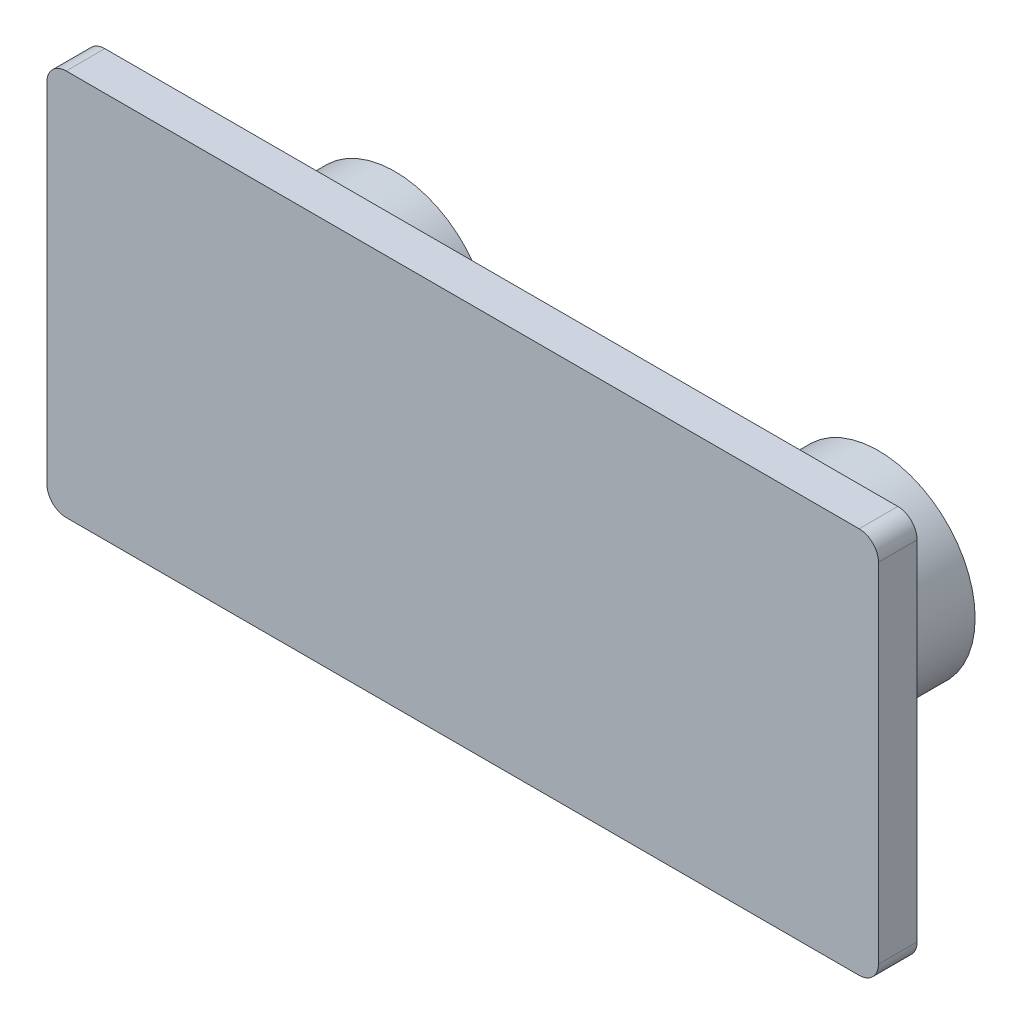
ISO-10303-21;
HEADER;
FILE_DESCRIPTION(('STEP AP214'),'2;1');
FILE_NAME('part.step','',(''),(''),'','','');
FILE_SCHEMA(('AUTOMOTIVE_DESIGN { 1 0 10303 214 1 1 1 1 }'));
ENDSEC;
DATA;
#1=APPLICATION_CONTEXT('core data for automotive mechanical design processes');
#2=APPLICATION_PROTOCOL_DEFINITION('international standard','automotive_design',2000,#1);
#3=PRODUCT_CONTEXT('',#1,'mechanical');
#4=PRODUCT('Part','Part','',(#3));
#5=PRODUCT_RELATED_PRODUCT_CATEGORY('part','',(#4));
#6=PRODUCT_DEFINITION_FORMATION('','',#4);
#7=PRODUCT_DEFINITION_CONTEXT('part definition',#1,'design');
#8=PRODUCT_DEFINITION('design','',#6,#7);
#9=PRODUCT_DEFINITION_SHAPE('','',#8);
#10=(LENGTH_UNIT() NAMED_UNIT(*) SI_UNIT(.MILLI.,.METRE.));
#11=(NAMED_UNIT(*) PLANE_ANGLE_UNIT() SI_UNIT($,.RADIAN.));
#12=(NAMED_UNIT(*) SI_UNIT($,.STERADIAN.) SOLID_ANGLE_UNIT());
#13=UNCERTAINTY_MEASURE_WITH_UNIT(LENGTH_MEASURE(1.E-05),#10,'distance_accuracy_value','');
#14=(GEOMETRIC_REPRESENTATION_CONTEXT(3) GLOBAL_UNCERTAINTY_ASSIGNED_CONTEXT((#13)) GLOBAL_UNIT_ASSIGNED_CONTEXT((#10,
#11,#12)) REPRESENTATION_CONTEXT('',''));
#15=CARTESIAN_POINT('',(0.,0.,0.));
#16=DIRECTION('',(0.,0.,1.));
#17=DIRECTION('',(1.,0.,0.));
#18=AXIS2_PLACEMENT_3D('',#15,#16,#17);
#19=CARTESIAN_POINT('',(21.5,-10.,1.));
#20=DIRECTION('',(-1.,0.,0.));
#21=DIRECTION('',(0.,0.,1.));
#22=AXIS2_PLACEMENT_3D('',#19,#20,#21);
#23=PLANE('',#22);
#24=DIRECTION('',(0.,1.,0.));
#25=VECTOR('',#24,1.);
#26=CARTESIAN_POINT('',(21.5,-10.,-1.));
#27=LINE('',#26,#25);
#28=CARTESIAN_POINT('',(21.5,-9.,-1.));
#29=VERTEX_POINT('',#28);
#30=CARTESIAN_POINT('',(21.5,9.,-1.));
#31=VERTEX_POINT('',#30);
#32=EDGE_CURVE('E126',#29,#31,#27,.T.);
#33=ORIENTED_EDGE('',*,*,#32,.T.);
#34=DIRECTION('',(0.,0.,-1.));
#35=VECTOR('',#34,1.);
#36=CARTESIAN_POINT('',(21.5,9.,1.));
#37=LINE('',#36,#35);
#38=CARTESIAN_POINT('',(21.5,9.,1.));
#39=VERTEX_POINT('',#38);
#40=EDGE_CURVE('E104',#31,#39,#37,.F.);
#41=ORIENTED_EDGE('',*,*,#40,.T.);
#42=DIRECTION('',(0.,1.,0.));
#43=VECTOR('',#42,1.);
#44=CARTESIAN_POINT('',(21.5,-10.,1.));
#45=LINE('',#44,#43);
#46=CARTESIAN_POINT('',(21.5,-9.,1.));
#47=VERTEX_POINT('',#46);
#48=EDGE_CURVE('E136',#47,#39,#45,.T.);
#49=ORIENTED_EDGE('',*,*,#48,.F.);
#50=DIRECTION('',(0.,0.,-1.));
#51=VECTOR('',#50,1.);
#52=CARTESIAN_POINT('',(21.5,-9.,1.));
#53=LINE('',#52,#51);
#54=EDGE_CURVE('E109',#47,#29,#53,.T.);
#55=ORIENTED_EDGE('',*,*,#54,.T.);
#56=EDGE_LOOP('',(#33,#41,#49,#55));
#57=FACE_BOUND('',#56,.T.);
#58=ADVANCED_FACE('F33',(#57),#23,.F.);
#59=CARTESIAN_POINT('',(-21.5,10.,1.));
#60=DIRECTION('',(0.,-1.,0.));
#61=DIRECTION('',(0.,0.,-1.));
#62=AXIS2_PLACEMENT_3D('',#59,#60,#61);
#63=PLANE('',#62);
#64=DIRECTION('',(-1.,0.,0.));
#65=VECTOR('',#64,1.);
#66=CARTESIAN_POINT('',(-21.5,10.,1.));
#67=LINE('',#66,#65);
#68=CARTESIAN_POINT('',(20.5,10.,1.));
#69=VERTEX_POINT('',#68);
#70=CARTESIAN_POINT('',(-20.5,10.,1.));
#71=VERTEX_POINT('',#70);
#72=EDGE_CURVE('E119',#69,#71,#67,.T.);
#73=ORIENTED_EDGE('',*,*,#72,.F.);
#74=DIRECTION('',(0.,0.,-1.));
#75=VECTOR('',#74,1.);
#76=CARTESIAN_POINT('',(20.5,10.,1.));
#77=LINE('',#76,#75);
#78=CARTESIAN_POINT('',(20.5,10.,-1.));
#79=VERTEX_POINT('',#78);
#80=EDGE_CURVE('E103',#69,#79,#77,.T.);
#81=ORIENTED_EDGE('',*,*,#80,.T.);
#82=DIRECTION('',(-1.,0.,0.));
#83=VECTOR('',#82,1.);
#84=CARTESIAN_POINT('',(-21.5,10.,-1.));
#85=LINE('',#84,#83);
#86=CARTESIAN_POINT('',(-20.5,10.,-1.));
#87=VERTEX_POINT('',#86);
#88=EDGE_CURVE('E116',#79,#87,#85,.T.);
#89=ORIENTED_EDGE('',*,*,#88,.T.);
#90=DIRECTION('',(0.,0.,-1.));
#91=VECTOR('',#90,1.);
#92=CARTESIAN_POINT('',(-20.5,10.,1.));
#93=LINE('',#92,#91);
#94=EDGE_CURVE('E121',#87,#71,#93,.F.);
#95=ORIENTED_EDGE('',*,*,#94,.T.);
#96=EDGE_LOOP('',(#73,#81,#89,#95));
#97=FACE_BOUND('',#96,.T.);
#98=ADVANCED_FACE('F115',(#97),#63,.F.);
#99=CARTESIAN_POINT('',(-21.5,-10.,1.));
#100=DIRECTION('',(1.,0.,0.));
#101=DIRECTION('',(0.,0.,-1.));
#102=AXIS2_PLACEMENT_3D('',#99,#100,#101);
#103=PLANE('',#102);
#104=DIRECTION('',(0.,-1.,0.));
#105=VECTOR('',#104,1.);
#106=CARTESIAN_POINT('',(-21.5,-10.,-1.));
#107=LINE('',#106,#105);
#108=CARTESIAN_POINT('',(-21.5,9.,-1.));
#109=VERTEX_POINT('',#108);
#110=CARTESIAN_POINT('',(-21.5,-9.,-1.));
#111=VERTEX_POINT('',#110);
#112=EDGE_CURVE('E125',#109,#111,#107,.T.);
#113=ORIENTED_EDGE('',*,*,#112,.T.);
#114=DIRECTION('',(0.,0.,-1.));
#115=VECTOR('',#114,1.);
#116=CARTESIAN_POINT('',(-21.5,-9.,1.));
#117=LINE('',#116,#115);
#118=CARTESIAN_POINT('',(-21.5,-9.,1.));
#119=VERTEX_POINT('',#118);
#120=EDGE_CURVE('E11',#111,#119,#117,.F.);
#121=ORIENTED_EDGE('',*,*,#120,.T.);
#122=DIRECTION('',(0.,-1.,0.));
#123=VECTOR('',#122,1.);
#124=CARTESIAN_POINT('',(-21.5,-10.,1.));
#125=LINE('',#124,#123);
#126=CARTESIAN_POINT('',(-21.5,9.,1.));
#127=VERTEX_POINT('',#126);
#128=EDGE_CURVE('E174',#127,#119,#125,.T.);
#129=ORIENTED_EDGE('',*,*,#128,.F.);
#130=DIRECTION('',(0.,0.,-1.));
#131=VECTOR('',#130,1.);
#132=CARTESIAN_POINT('',(-21.5,9.,1.));
#133=LINE('',#132,#131);
#134=EDGE_CURVE('E41',#127,#109,#133,.T.);
#135=ORIENTED_EDGE('',*,*,#134,.T.);
#136=EDGE_LOOP('',(#113,#121,#129,#135));
#137=FACE_BOUND('',#136,.T.);
#138=ADVANCED_FACE('F172',(#137),#103,.F.);
#139=CARTESIAN_POINT('',(-21.5,-10.,1.));
#140=DIRECTION('',(0.,1.,0.));
#141=DIRECTION('',(0.,0.,1.));
#142=AXIS2_PLACEMENT_3D('',#139,#140,#141);
#143=PLANE('',#142);
#144=DIRECTION('',(1.,0.,0.));
#145=VECTOR('',#144,1.);
#146=CARTESIAN_POINT('',(-21.5,-10.,-1.));
#147=LINE('',#146,#145);
#148=CARTESIAN_POINT('',(-20.5,-10.,-1.));
#149=VERTEX_POINT('',#148);
#150=CARTESIAN_POINT('',(20.5,-10.,-1.));
#151=VERTEX_POINT('',#150);
#152=EDGE_CURVE('E129',#149,#151,#147,.T.);
#153=ORIENTED_EDGE('',*,*,#152,.T.);
#154=DIRECTION('',(0.,0.,-1.));
#155=VECTOR('',#154,1.);
#156=CARTESIAN_POINT('',(20.5,-10.,1.));
#157=LINE('',#156,#155);
#158=CARTESIAN_POINT('',(20.5,-10.,1.));
#159=VERTEX_POINT('',#158);
#160=EDGE_CURVE('E48',#151,#159,#157,.F.);
#161=ORIENTED_EDGE('',*,*,#160,.T.);
#162=DIRECTION('',(1.,0.,0.));
#163=VECTOR('',#162,1.);
#164=CARTESIAN_POINT('',(-21.5,-10.,1.));
#165=LINE('',#164,#163);
#166=CARTESIAN_POINT('',(-20.5,-10.,1.));
#167=VERTEX_POINT('',#166);
#168=EDGE_CURVE('E141',#167,#159,#165,.T.);
#169=ORIENTED_EDGE('',*,*,#168,.F.);
#170=DIRECTION('',(0.,0.,-1.));
#171=VECTOR('',#170,1.);
#172=CARTESIAN_POINT('',(-20.5,-10.,1.));
#173=LINE('',#172,#171);
#174=EDGE_CURVE('E165',#167,#149,#173,.T.);
#175=ORIENTED_EDGE('',*,*,#174,.T.);
#176=EDGE_LOOP('',(#153,#161,#169,#175));
#177=FACE_BOUND('',#176,.T.);
#178=ADVANCED_FACE('F181',(#177),#143,.F.);
#179=CARTESIAN_POINT('',(0.,0.,1.));
#180=DIRECTION('',(0.,0.,-1.));
#181=DIRECTION('',(-1.,0.,0.));
#182=AXIS2_PLACEMENT_3D('',#179,#180,#181);
#183=PLANE('',#182);
#184=ORIENTED_EDGE('',*,*,#48,.T.);
#185=CARTESIAN_POINT('',(20.5,9.,1.));
#186=DIRECTION('',(0.,0.,-1.));
#187=DIRECTION('',(-1.,0.,0.));
#188=AXIS2_PLACEMENT_3D('',#185,#186,#187);
#189=CIRCLE('',#188,1.);
#190=EDGE_CURVE('E163',#39,#69,#189,.F.);
#191=ORIENTED_EDGE('',*,*,#190,.T.);
#192=ORIENTED_EDGE('',*,*,#72,.T.);
#193=CARTESIAN_POINT('',(-20.5,9.,1.));
#194=DIRECTION('',(0.,0.,-1.));
#195=DIRECTION('',(-1.,0.,0.));
#196=AXIS2_PLACEMENT_3D('',#193,#194,#195);
#197=CIRCLE('',#196,1.);
#198=EDGE_CURVE('E158',#71,#127,#197,.F.);
#199=ORIENTED_EDGE('',*,*,#198,.T.);
#200=ORIENTED_EDGE('',*,*,#128,.T.);
#201=CARTESIAN_POINT('',(-20.5,-9.,1.));
#202=DIRECTION('',(0.,0.,-1.));
#203=DIRECTION('',(-1.,0.,0.));
#204=AXIS2_PLACEMENT_3D('',#201,#202,#203);
#205=CIRCLE('',#204,1.);
#206=EDGE_CURVE('E55',#119,#167,#205,.F.);
#207=ORIENTED_EDGE('',*,*,#206,.T.);
#208=ORIENTED_EDGE('',*,*,#168,.T.);
#209=CARTESIAN_POINT('',(20.5,-9.,1.));
#210=DIRECTION('',(0.,0.,-1.));
#211=DIRECTION('',(-1.,0.,0.));
#212=AXIS2_PLACEMENT_3D('',#209,#210,#211);
#213=CIRCLE('',#212,1.);
#214=EDGE_CURVE('E161',#159,#47,#213,.F.);
#215=ORIENTED_EDGE('',*,*,#214,.T.);
#216=EDGE_LOOP('',(#184,#191,#192,#199,#200,#207,#208,#215));
#217=FACE_BOUND('',#216,.T.);
#218=ADVANCED_FACE('F233',(#217),#183,.F.);
#219=CARTESIAN_POINT('',(0.,0.,-1.));
#220=DIRECTION('',(0.,0.,-1.));
#221=DIRECTION('',(-1.,0.,0.));
#222=AXIS2_PLACEMENT_3D('',#219,#220,#221);
#223=PLANE('',#222);
#224=CARTESIAN_POINT('',(-12.5,0.,-1.));
#225=DIRECTION('',(0.,0.,-1.));
#226=DIRECTION('',(-1.,0.,0.));
#227=AXIS2_PLACEMENT_3D('',#224,#225,#226);
#228=CIRCLE('',#227,7.);
#229=CARTESIAN_POINT('',(-19.5,0.,-1.));
#230=VERTEX_POINT('',#229);
#231=EDGE_CURVE('E144',#230,#230,#228,.F.);
#232=ORIENTED_EDGE('',*,*,#231,.T.);
#233=EDGE_LOOP('',(#232));
#234=FACE_BOUND('',#233,.T.);
#235=CARTESIAN_POINT('',(12.5,0.,-1.));
#236=DIRECTION('',(0.,0.,-1.));
#237=DIRECTION('',(-1.,0.,0.));
#238=AXIS2_PLACEMENT_3D('',#235,#236,#237);
#239=CIRCLE('',#238,7.);
#240=CARTESIAN_POINT('',(5.5,0.,-1.));
#241=VERTEX_POINT('',#240);
#242=EDGE_CURVE('E140',#241,#241,#239,.F.);
#243=ORIENTED_EDGE('',*,*,#242,.T.);
#244=EDGE_LOOP('',(#243));
#245=FACE_BOUND('',#244,.T.);
#246=ORIENTED_EDGE('',*,*,#88,.F.);
#247=CARTESIAN_POINT('',(20.5,9.,-1.));
#248=DIRECTION('',(0.,0.,-1.));
#249=DIRECTION('',(-1.,0.,0.));
#250=AXIS2_PLACEMENT_3D('',#247,#248,#249);
#251=CIRCLE('',#250,1.);
#252=EDGE_CURVE('E99',#79,#31,#251,.T.);
#253=ORIENTED_EDGE('',*,*,#252,.T.);
#254=ORIENTED_EDGE('',*,*,#32,.F.);
#255=CARTESIAN_POINT('',(20.5,-9.,-1.));
#256=DIRECTION('',(0.,0.,-1.));
#257=DIRECTION('',(-1.,0.,0.));
#258=AXIS2_PLACEMENT_3D('',#255,#256,#257);
#259=CIRCLE('',#258,1.);
#260=EDGE_CURVE('E110',#29,#151,#259,.T.);
#261=ORIENTED_EDGE('',*,*,#260,.T.);
#262=ORIENTED_EDGE('',*,*,#152,.F.);
#263=CARTESIAN_POINT('',(-20.5,-9.,-1.));
#264=DIRECTION('',(0.,0.,-1.));
#265=DIRECTION('',(-1.,0.,0.));
#266=AXIS2_PLACEMENT_3D('',#263,#264,#265);
#267=CIRCLE('',#266,1.);
#268=EDGE_CURVE('E152',#149,#111,#267,.T.);
#269=ORIENTED_EDGE('',*,*,#268,.T.);
#270=ORIENTED_EDGE('',*,*,#112,.F.);
#271=CARTESIAN_POINT('',(-20.5,9.,-1.));
#272=DIRECTION('',(0.,0.,-1.));
#273=DIRECTION('',(-1.,0.,0.));
#274=AXIS2_PLACEMENT_3D('',#271,#272,#273);
#275=CIRCLE('',#274,1.);
#276=EDGE_CURVE('E120',#109,#87,#275,.T.);
#277=ORIENTED_EDGE('',*,*,#276,.T.);
#278=EDGE_LOOP('',(#246,#253,#254,#261,#262,#269,#270,#277));
#279=FACE_BOUND('',#278,.T.);
#280=ADVANCED_FACE('F123',(#234,#245,#279),#223,.T.);
#281=CARTESIAN_POINT('',(-12.5,0.,-8.));
#282=DIRECTION('',(0.,0.,1.));
#283=DIRECTION('',(1.,0.,0.));
#284=AXIS2_PLACEMENT_3D('',#281,#282,#283);
#285=CYLINDRICAL_SURFACE('',#284,5.);
#286=CARTESIAN_POINT('',(-12.5,0.,-3.));
#287=DIRECTION('',(0.,0.,-1.));
#288=DIRECTION('',(-1.,0.,0.));
#289=AXIS2_PLACEMENT_3D('',#286,#287,#288);
#290=CIRCLE('',#289,5.);
#291=CARTESIAN_POINT('',(-17.5,0.,-3.));
#292=VERTEX_POINT('',#291);
#293=EDGE_CURVE('E137',#292,#292,#290,.T.);
#294=ORIENTED_EDGE('',*,*,#293,.T.);
#295=EDGE_LOOP('',(#294));
#296=FACE_BOUND('',#295,.T.);
#297=CARTESIAN_POINT('',(-12.5,0.,-8.));
#298=DIRECTION('',(0.,0.,1.));
#299=DIRECTION('',(1.,0.,0.));
#300=AXIS2_PLACEMENT_3D('',#297,#298,#299);
#301=CIRCLE('',#300,5.);
#302=CARTESIAN_POINT('',(-7.5,0.,-8.));
#303=VERTEX_POINT('',#302);
#304=EDGE_CURVE('E131',#303,#303,#301,.T.);
#305=ORIENTED_EDGE('',*,*,#304,.T.);
#306=EDGE_LOOP('',(#305));
#307=FACE_BOUND('',#306,.T.);
#308=ADVANCED_FACE('F242',(#296,#307),#285,.T.);
#309=CARTESIAN_POINT('',(-12.5,0.,-8.));
#310=DIRECTION('',(0.,0.,1.));
#311=DIRECTION('',(1.,0.,0.));
#312=AXIS2_PLACEMENT_3D('',#309,#310,#311);
#313=PLANE('',#312);
#314=ORIENTED_EDGE('',*,*,#304,.F.);
#315=EDGE_LOOP('',(#314));
#316=FACE_BOUND('',#315,.T.);
#317=ADVANCED_FACE('F207',(#316),#313,.F.);
#318=CARTESIAN_POINT('',(12.5,0.,-8.));
#319=DIRECTION('',(0.,0.,1.));
#320=DIRECTION('',(1.,0.,0.));
#321=AXIS2_PLACEMENT_3D('',#318,#319,#320);
#322=CYLINDRICAL_SURFACE('',#321,5.);
#323=CARTESIAN_POINT('',(12.5,0.,-3.));
#324=DIRECTION('',(0.,0.,-1.));
#325=DIRECTION('',(-1.,0.,0.));
#326=AXIS2_PLACEMENT_3D('',#323,#324,#325);
#327=CIRCLE('',#326,5.);
#328=CARTESIAN_POINT('',(7.5,0.,-3.));
#329=VERTEX_POINT('',#328);
#330=EDGE_CURVE('E147',#329,#329,#327,.T.);
#331=ORIENTED_EDGE('',*,*,#330,.T.);
#332=EDGE_LOOP('',(#331));
#333=FACE_BOUND('',#332,.T.);
#334=CARTESIAN_POINT('',(12.5,0.,-8.));
#335=DIRECTION('',(0.,0.,1.));
#336=DIRECTION('',(1.,0.,0.));
#337=AXIS2_PLACEMENT_3D('',#334,#335,#336);
#338=CIRCLE('',#337,5.);
#339=CARTESIAN_POINT('',(17.5,0.,-8.));
#340=VERTEX_POINT('',#339);
#341=EDGE_CURVE('E190',#340,#340,#338,.T.);
#342=ORIENTED_EDGE('',*,*,#341,.T.);
#343=EDGE_LOOP('',(#342));
#344=FACE_BOUND('',#343,.T.);
#345=ADVANCED_FACE('F194',(#333,#344),#322,.T.);
#346=CARTESIAN_POINT('',(12.5,0.,-8.));
#347=DIRECTION('',(0.,0.,1.));
#348=DIRECTION('',(1.,0.,0.));
#349=AXIS2_PLACEMENT_3D('',#346,#347,#348);
#350=PLANE('',#349);
#351=ORIENTED_EDGE('',*,*,#341,.F.);
#352=EDGE_LOOP('',(#351));
#353=FACE_BOUND('',#352,.T.);
#354=ADVANCED_FACE('F196',(#353),#350,.F.);
#355=CARTESIAN_POINT('',(-12.5,0.,-3.));
#356=DIRECTION('',(0.,0.,-1.));
#357=DIRECTION('',(-1.,0.,0.));
#358=AXIS2_PLACEMENT_3D('',#355,#356,#357);
#359=TOROIDAL_SURFACE('',#358,7.,2.);
#360=ORIENTED_EDGE('',*,*,#231,.F.);
#361=EDGE_LOOP('',(#360));
#362=FACE_BOUND('',#361,.T.);
#363=ORIENTED_EDGE('',*,*,#293,.F.);
#364=EDGE_LOOP('',(#363));
#365=FACE_BOUND('',#364,.T.);
#366=ADVANCED_FACE('F198',(#362,#365),#359,.F.);
#367=CARTESIAN_POINT('',(12.5,0.,-3.));
#368=DIRECTION('',(0.,0.,-1.));
#369=DIRECTION('',(-1.,0.,0.));
#370=AXIS2_PLACEMENT_3D('',#367,#368,#369);
#371=TOROIDAL_SURFACE('',#370,7.,2.);
#372=ORIENTED_EDGE('',*,*,#242,.F.);
#373=EDGE_LOOP('',(#372));
#374=FACE_BOUND('',#373,.T.);
#375=ORIENTED_EDGE('',*,*,#330,.F.);
#376=EDGE_LOOP('',(#375));
#377=FACE_BOUND('',#376,.T.);
#378=ADVANCED_FACE('F204',(#374,#377),#371,.F.);
#379=CARTESIAN_POINT('',(20.5,9.,1.));
#380=DIRECTION('',(0.,0.,-1.));
#381=DIRECTION('',(-1.,0.,0.));
#382=AXIS2_PLACEMENT_3D('',#379,#380,#381);
#383=CYLINDRICAL_SURFACE('',#382,1.);
#384=ORIENTED_EDGE('',*,*,#190,.F.);
#385=ORIENTED_EDGE('',*,*,#40,.F.);
#386=ORIENTED_EDGE('',*,*,#252,.F.);
#387=ORIENTED_EDGE('',*,*,#80,.F.);
#388=EDGE_LOOP('',(#384,#385,#386,#387));
#389=FACE_BOUND('',#388,.T.);
#390=ADVANCED_FACE('F102',(#389),#383,.T.);
#391=CARTESIAN_POINT('',(20.5,-9.,1.));
#392=DIRECTION('',(0.,0.,-1.));
#393=DIRECTION('',(-1.,0.,0.));
#394=AXIS2_PLACEMENT_3D('',#391,#392,#393);
#395=CYLINDRICAL_SURFACE('',#394,1.);
#396=ORIENTED_EDGE('',*,*,#214,.F.);
#397=ORIENTED_EDGE('',*,*,#160,.F.);
#398=ORIENTED_EDGE('',*,*,#260,.F.);
#399=ORIENTED_EDGE('',*,*,#54,.F.);
#400=EDGE_LOOP('',(#396,#397,#398,#399));
#401=FACE_BOUND('',#400,.T.);
#402=ADVANCED_FACE('F224',(#401),#395,.T.);
#403=CARTESIAN_POINT('',(-20.5,-9.,1.));
#404=DIRECTION('',(0.,0.,-1.));
#405=DIRECTION('',(-1.,0.,0.));
#406=AXIS2_PLACEMENT_3D('',#403,#404,#405);
#407=CYLINDRICAL_SURFACE('',#406,1.);
#408=ORIENTED_EDGE('',*,*,#206,.F.);
#409=ORIENTED_EDGE('',*,*,#120,.F.);
#410=ORIENTED_EDGE('',*,*,#268,.F.);
#411=ORIENTED_EDGE('',*,*,#174,.F.);
#412=EDGE_LOOP('',(#408,#409,#410,#411));
#413=FACE_BOUND('',#412,.T.);
#414=ADVANCED_FACE('F180',(#413),#407,.T.);
#415=CARTESIAN_POINT('',(-20.5,9.,1.));
#416=DIRECTION('',(0.,0.,-1.));
#417=DIRECTION('',(-1.,0.,0.));
#418=AXIS2_PLACEMENT_3D('',#415,#416,#417);
#419=CYLINDRICAL_SURFACE('',#418,1.);
#420=ORIENTED_EDGE('',*,*,#198,.F.);
#421=ORIENTED_EDGE('',*,*,#94,.F.);
#422=ORIENTED_EDGE('',*,*,#276,.F.);
#423=ORIENTED_EDGE('',*,*,#134,.F.);
#424=EDGE_LOOP('',(#420,#421,#422,#423));
#425=FACE_BOUND('',#424,.T.);
#426=ADVANCED_FACE('F35',(#425),#419,.T.);
#427=CLOSED_SHELL('',(#58,#98,#138,#178,#218,#280,#308,#317,#345,#354,#366,#378,#390,#402,#414,#426));
#428=MANIFOLD_SOLID_BREP('B2',#427);
#429=ADVANCED_BREP_SHAPE_REPRESENTATION('',(#18,#428),#14);
#430=SHAPE_DEFINITION_REPRESENTATION(#9,#429);
ENDSEC;
END-ISO-10303-21;
